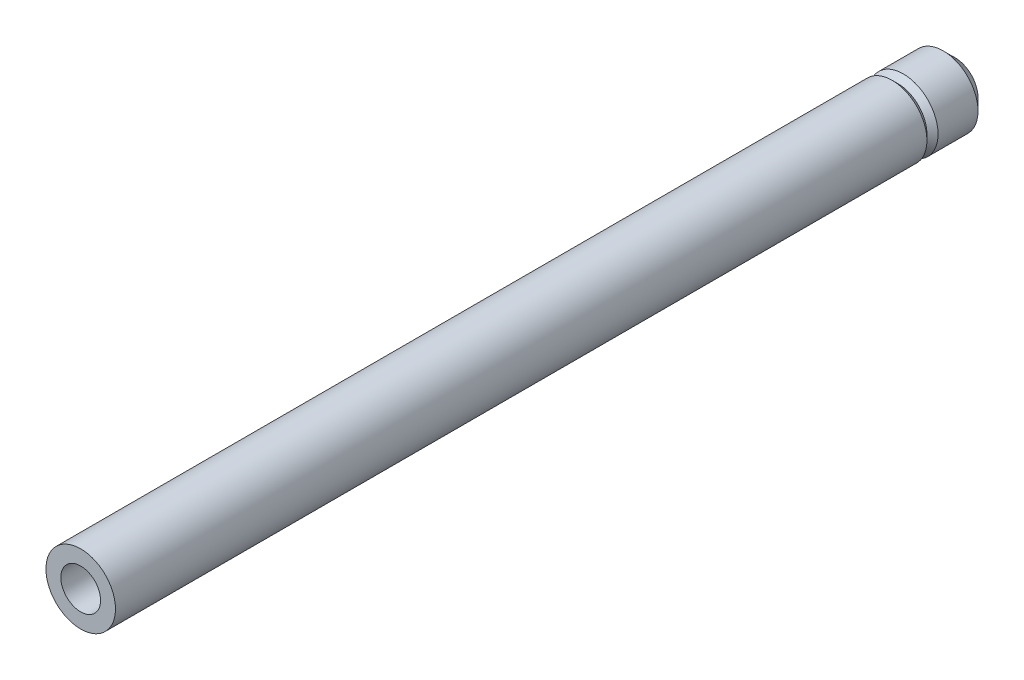
ISO-10303-21;
HEADER;
FILE_DESCRIPTION(('STEP AP214'),'2;1');
FILE_NAME('part.step','',(''),(''),'','','');
FILE_SCHEMA(('AUTOMOTIVE_DESIGN { 1 0 10303 214 1 1 1 1 }'));
ENDSEC;
DATA;
#1=APPLICATION_CONTEXT('core data for automotive mechanical design processes');
#2=APPLICATION_PROTOCOL_DEFINITION('international standard','automotive_design',2000,#1);
#3=PRODUCT_CONTEXT('',#1,'mechanical');
#4=PRODUCT('Part','Part','',(#3));
#5=PRODUCT_RELATED_PRODUCT_CATEGORY('part','',(#4));
#6=PRODUCT_DEFINITION_FORMATION('','',#4);
#7=PRODUCT_DEFINITION_CONTEXT('part definition',#1,'design');
#8=PRODUCT_DEFINITION('design','',#6,#7);
#9=PRODUCT_DEFINITION_SHAPE('','',#8);
#10=(LENGTH_UNIT() NAMED_UNIT(*) SI_UNIT(.MILLI.,.METRE.));
#11=(NAMED_UNIT(*) PLANE_ANGLE_UNIT() SI_UNIT($,.RADIAN.));
#12=(NAMED_UNIT(*) SI_UNIT($,.STERADIAN.) SOLID_ANGLE_UNIT());
#13=UNCERTAINTY_MEASURE_WITH_UNIT(LENGTH_MEASURE(1.E-05),#10,'distance_accuracy_value','');
#14=(GEOMETRIC_REPRESENTATION_CONTEXT(3) GLOBAL_UNCERTAINTY_ASSIGNED_CONTEXT((#13)) GLOBAL_UNIT_ASSIGNED_CONTEXT((#10,
#11,#12)) REPRESENTATION_CONTEXT('',''));
#15=CARTESIAN_POINT('',(0.,0.,0.));
#16=DIRECTION('',(0.,0.,1.));
#17=DIRECTION('',(1.,0.,0.));
#18=AXIS2_PLACEMENT_3D('',#15,#16,#17);
#19=CARTESIAN_POINT('',(0.,11.1125,184.976381406363));
#20=DIRECTION('',(0.,0.,-1.));
#21=DIRECTION('',(-1.,0.,0.));
#22=AXIS2_PLACEMENT_3D('',#19,#20,#21);
#23=PLANE('',#22);
#24=CARTESIAN_POINT('',(0.,0.,184.976381406363));
#25=DIRECTION('',(0.,0.,1.));
#26=DIRECTION('',(1.,0.,0.));
#27=AXIS2_PLACEMENT_3D('',#24,#25,#26);
#28=CIRCLE('',#27,6.35);
#29=CARTESIAN_POINT('',(6.35,0.,184.976381406363));
#30=VERTEX_POINT('',#29);
#31=EDGE_CURVE('E10',#30,#30,#28,.T.);
#32=ORIENTED_EDGE('',*,*,#31,.F.);
#33=EDGE_LOOP('',(#32));
#34=FACE_BOUND('',#33,.T.);
#35=CARTESIAN_POINT('',(0.,0.,184.976381406363));
#36=DIRECTION('',(0.,0.,1.));
#37=DIRECTION('',(1.,0.,0.));
#38=AXIS2_PLACEMENT_3D('',#35,#36,#37);
#39=CIRCLE('',#38,11.1125);
#40=CARTESIAN_POINT('',(11.1125,0.,184.976381406363));
#41=VERTEX_POINT('',#40);
#42=EDGE_CURVE('E68',#41,#41,#39,.T.);
#43=ORIENTED_EDGE('',*,*,#42,.T.);
#44=EDGE_LOOP('',(#43));
#45=FACE_BOUND('',#44,.T.);
#46=ADVANCED_FACE('F34',(#34,#45),#23,.F.);
#47=CARTESIAN_POINT('',(0.,0.,90.1301223306732));
#48=DIRECTION('',(0.,0.,1.));
#49=DIRECTION('',(1.,0.,0.));
#50=AXIS2_PLACEMENT_3D('',#47,#48,#49);
#51=CYLINDRICAL_SURFACE('',#50,6.35);
#52=CARTESIAN_POINT('',(0.,0.,-91.8836185936367));
#53=DIRECTION('',(0.,0.,1.));
#54=DIRECTION('',(1.,0.,0.));
#55=AXIS2_PLACEMENT_3D('',#52,#53,#54);
#56=CIRCLE('',#55,6.35);
#57=CARTESIAN_POINT('',(6.35,0.,-91.8836185936367));
#58=VERTEX_POINT('',#57);
#59=EDGE_CURVE('E40',#58,#58,#56,.T.);
#60=ORIENTED_EDGE('',*,*,#59,.F.);
#61=EDGE_LOOP('',(#60));
#62=FACE_BOUND('',#61,.T.);
#63=ORIENTED_EDGE('',*,*,#31,.T.);
#64=EDGE_LOOP('',(#63));
#65=FACE_BOUND('',#64,.T.);
#66=ADVANCED_FACE('F117',(#62,#65),#51,.F.);
#67=CARTESIAN_POINT('',(0.,6.35,-91.8836185936367));
#68=DIRECTION('',(0.,0.,1.));
#69=DIRECTION('',(1.,0.,0.));
#70=AXIS2_PLACEMENT_3D('',#67,#68,#69);
#71=PLANE('',#70);
#72=CARTESIAN_POINT('',(0.,0.,-91.8836185936367));
#73=DIRECTION('',(0.,0.,1.));
#74=DIRECTION('',(1.,0.,0.));
#75=AXIS2_PLACEMENT_3D('',#72,#73,#74);
#76=CIRCLE('',#75,6.858);
#77=CARTESIAN_POINT('',(6.858,0.,-91.8836185936367));
#78=VERTEX_POINT('',#77);
#79=EDGE_CURVE('E44',#78,#78,#76,.T.);
#80=ORIENTED_EDGE('',*,*,#79,.F.);
#81=EDGE_LOOP('',(#80));
#82=FACE_BOUND('',#81,.T.);
#83=ORIENTED_EDGE('',*,*,#59,.T.);
#84=EDGE_LOOP('',(#83));
#85=FACE_BOUND('',#84,.T.);
#86=ADVANCED_FACE('F112',(#82,#85),#71,.F.);
#87=CARTESIAN_POINT('',(0.,0.,90.1301223306732));
#88=DIRECTION('',(0.,0.,1.));
#89=DIRECTION('',(1.,0.,0.));
#90=AXIS2_PLACEMENT_3D('',#87,#88,#89);
#91=CYLINDRICAL_SURFACE('',#90,6.858);
#92=CARTESIAN_POINT('',(0.,0.,-94.4236185936367));
#93=DIRECTION('',(0.,0.,1.));
#94=DIRECTION('',(1.,0.,0.));
#95=AXIS2_PLACEMENT_3D('',#92,#93,#94);
#96=CIRCLE('',#95,6.858);
#97=CARTESIAN_POINT('',(6.858,0.,-94.4236185936367));
#98=VERTEX_POINT('',#97);
#99=EDGE_CURVE('E48',#98,#98,#96,.T.);
#100=ORIENTED_EDGE('',*,*,#99,.F.);
#101=EDGE_LOOP('',(#100));
#102=FACE_BOUND('',#101,.T.);
#103=ORIENTED_EDGE('',*,*,#79,.T.);
#104=EDGE_LOOP('',(#103));
#105=FACE_BOUND('',#104,.T.);
#106=ADVANCED_FACE('F106',(#102,#105),#91,.F.);
#107=CARTESIAN_POINT('',(0.,6.858,-94.4236185936367));
#108=DIRECTION('',(0.,0.,1.));
#109=DIRECTION('',(1.,0.,0.));
#110=AXIS2_PLACEMENT_3D('',#107,#108,#109);
#111=PLANE('',#110);
#112=CARTESIAN_POINT('',(0.,0.,-94.4236185936367));
#113=DIRECTION('',(0.,0.,1.));
#114=DIRECTION('',(1.,0.,0.));
#115=AXIS2_PLACEMENT_3D('',#112,#113,#114);
#116=CIRCLE('',#115,7.366);
#117=CARTESIAN_POINT('',(7.366,0.,-94.4236185936367));
#118=VERTEX_POINT('',#117);
#119=EDGE_CURVE('E53',#118,#118,#116,.T.);
#120=ORIENTED_EDGE('',*,*,#119,.F.);
#121=EDGE_LOOP('',(#120));
#122=FACE_BOUND('',#121,.T.);
#123=ORIENTED_EDGE('',*,*,#99,.T.);
#124=EDGE_LOOP('',(#123));
#125=FACE_BOUND('',#124,.T.);
#126=ADVANCED_FACE('F100',(#122,#125),#111,.F.);
#127=CARTESIAN_POINT('',(0.,0.,-94.4236185936367));
#128=DIRECTION('',(0.,0.,1.));
#129=DIRECTION('',(1.,0.,0.));
#130=AXIS2_PLACEMENT_3D('',#127,#128,#129);
#131=CONICAL_SURFACE('',#130,7.366,0.78539816339745);
#132=CARTESIAN_POINT('',(0.,0.,-90.6771185936367));
#133=DIRECTION('',(0.,0.,1.));
#134=DIRECTION('',(1.,0.,0.));
#135=AXIS2_PLACEMENT_3D('',#132,#133,#134);
#136=CIRCLE('',#135,11.1125);
#137=CARTESIAN_POINT('',(11.1125,0.,-90.6771185936367));
#138=VERTEX_POINT('',#137);
#139=EDGE_CURVE('E56',#138,#138,#136,.T.);
#140=ORIENTED_EDGE('',*,*,#139,.F.);
#141=EDGE_LOOP('',(#140));
#142=FACE_BOUND('',#141,.T.);
#143=ORIENTED_EDGE('',*,*,#119,.T.);
#144=EDGE_LOOP('',(#143));
#145=FACE_BOUND('',#144,.T.);
#146=ADVANCED_FACE('F94',(#142,#145),#131,.T.);
#147=CARTESIAN_POINT('',(0.,0.,90.1301223306732));
#148=DIRECTION('',(0.,0.,1.));
#149=DIRECTION('',(1.,0.,0.));
#150=AXIS2_PLACEMENT_3D('',#147,#148,#149);
#151=CYLINDRICAL_SURFACE('',#150,11.1125);
#152=CARTESIAN_POINT('',(0.,0.,-77.9136185936367));
#153=DIRECTION('',(0.,0.,1.));
#154=DIRECTION('',(1.,0.,0.));
#155=AXIS2_PLACEMENT_3D('',#152,#153,#154);
#156=CIRCLE('',#155,11.1125);
#157=CARTESIAN_POINT('',(11.1125,0.,-77.9136185936367));
#158=VERTEX_POINT('',#157);
#159=EDGE_CURVE('E59',#158,#158,#156,.T.);
#160=ORIENTED_EDGE('',*,*,#159,.F.);
#161=EDGE_LOOP('',(#160));
#162=FACE_BOUND('',#161,.T.);
#163=ORIENTED_EDGE('',*,*,#139,.T.);
#164=EDGE_LOOP('',(#163));
#165=FACE_BOUND('',#164,.T.);
#166=ADVANCED_FACE('F88',(#162,#165),#151,.T.);
#167=CARTESIAN_POINT('',(0.,0.,-77.9136185936367));
#168=DIRECTION('',(0.,0.,-1.));
#169=DIRECTION('',(-1.,0.,0.));
#170=AXIS2_PLACEMENT_3D('',#167,#168,#169);
#171=CONICAL_SURFACE('',#170,11.1125,0.785398163397441);
#172=CARTESIAN_POINT('',(0.,0.,-76.1356185936367));
#173=DIRECTION('',(0.,0.,1.));
#174=DIRECTION('',(1.,0.,0.));
#175=AXIS2_PLACEMENT_3D('',#172,#173,#174);
#176=CIRCLE('',#175,9.3345);
#177=CARTESIAN_POINT('',(9.3345,0.,-76.1356185936367));
#178=VERTEX_POINT('',#177);
#179=EDGE_CURVE('E62',#178,#178,#176,.T.);
#180=ORIENTED_EDGE('',*,*,#179,.F.);
#181=EDGE_LOOP('',(#180));
#182=FACE_BOUND('',#181,.T.);
#183=ORIENTED_EDGE('',*,*,#159,.T.);
#184=EDGE_LOOP('',(#183));
#185=FACE_BOUND('',#184,.T.);
#186=ADVANCED_FACE('F82',(#182,#185),#171,.T.);
#187=CARTESIAN_POINT('',(0.,0.,-76.1356185936367));
#188=DIRECTION('',(0.,0.,1.));
#189=DIRECTION('',(1.,0.,0.));
#190=AXIS2_PLACEMENT_3D('',#187,#188,#189);
#191=CONICAL_SURFACE('',#190,9.3345,0.785398163397448);
#192=CARTESIAN_POINT('',(0.,0.,-74.3576185936367));
#193=DIRECTION('',(0.,0.,1.));
#194=DIRECTION('',(1.,0.,0.));
#195=AXIS2_PLACEMENT_3D('',#192,#193,#194);
#196=CIRCLE('',#195,11.1125);
#197=CARTESIAN_POINT('',(11.1125,0.,-74.3576185936367));
#198=VERTEX_POINT('',#197);
#199=EDGE_CURVE('E65',#198,#198,#196,.T.);
#200=ORIENTED_EDGE('',*,*,#199,.F.);
#201=EDGE_LOOP('',(#200));
#202=FACE_BOUND('',#201,.T.);
#203=ORIENTED_EDGE('',*,*,#179,.T.);
#204=EDGE_LOOP('',(#203));
#205=FACE_BOUND('',#204,.T.);
#206=ADVANCED_FACE('F76',(#202,#205),#191,.T.);
#207=CARTESIAN_POINT('',(0.,0.,90.1301223306732));
#208=DIRECTION('',(0.,0.,1.));
#209=DIRECTION('',(1.,0.,0.));
#210=AXIS2_PLACEMENT_3D('',#207,#208,#209);
#211=CYLINDRICAL_SURFACE('',#210,11.1125);
#212=ORIENTED_EDGE('',*,*,#42,.F.);
#213=EDGE_LOOP('',(#212));
#214=FACE_BOUND('',#213,.T.);
#215=ORIENTED_EDGE('',*,*,#199,.T.);
#216=EDGE_LOOP('',(#215));
#217=FACE_BOUND('',#216,.T.);
#218=ADVANCED_FACE('F73',(#214,#217),#211,.T.);
#219=CLOSED_SHELL('',(#46,#66,#86,#106,#126,#146,#166,#186,#206,#218));
#220=MANIFOLD_SOLID_BREP('B2',#219);
#221=ADVANCED_BREP_SHAPE_REPRESENTATION('',(#18,#220),#14);
#222=SHAPE_DEFINITION_REPRESENTATION(#9,#221);
ENDSEC;
END-ISO-10303-21;
